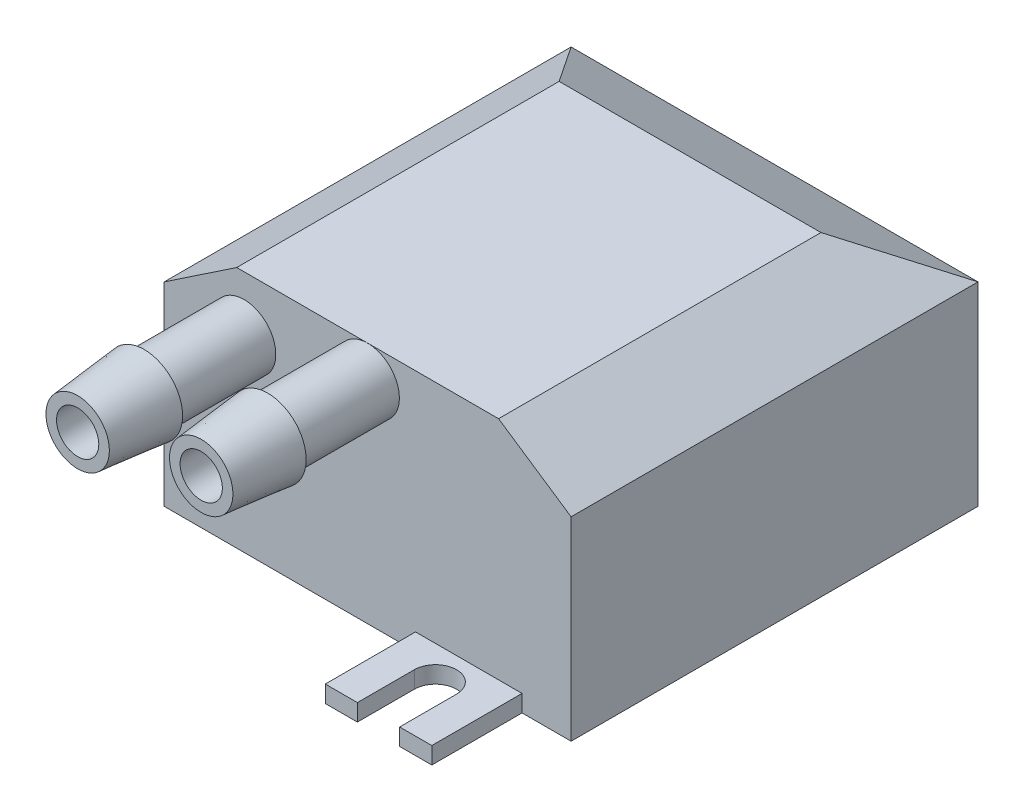
ISO-10303-21;
HEADER;
FILE_DESCRIPTION(('STEP AP214'),'2;1');
FILE_NAME('part.step','',(''),(''),'','','');
FILE_SCHEMA(('AUTOMOTIVE_DESIGN { 1 0 10303 214 1 1 1 1 }'));
ENDSEC;
DATA;
#1=APPLICATION_CONTEXT('core data for automotive mechanical design processes');
#2=APPLICATION_PROTOCOL_DEFINITION('international standard','automotive_design',2000,#1);
#3=PRODUCT_CONTEXT('',#1,'mechanical');
#4=PRODUCT('Part','Part','',(#3));
#5=PRODUCT_RELATED_PRODUCT_CATEGORY('part','',(#4));
#6=PRODUCT_DEFINITION_FORMATION('','',#4);
#7=PRODUCT_DEFINITION_CONTEXT('part definition',#1,'design');
#8=PRODUCT_DEFINITION('design','',#6,#7);
#9=PRODUCT_DEFINITION_SHAPE('','',#8);
#10=(LENGTH_UNIT() NAMED_UNIT(*) SI_UNIT(.MILLI.,.METRE.));
#11=(NAMED_UNIT(*) PLANE_ANGLE_UNIT() SI_UNIT($,.RADIAN.));
#12=(NAMED_UNIT(*) SI_UNIT($,.STERADIAN.) SOLID_ANGLE_UNIT());
#13=UNCERTAINTY_MEASURE_WITH_UNIT(LENGTH_MEASURE(1.E-05),#10,'distance_accuracy_value','');
#14=(GEOMETRIC_REPRESENTATION_CONTEXT(3) GLOBAL_UNCERTAINTY_ASSIGNED_CONTEXT((#13)) GLOBAL_UNIT_ASSIGNED_CONTEXT((#10,
#11,#12)) REPRESENTATION_CONTEXT('',''));
#15=CARTESIAN_POINT('',(0.,0.,0.));
#16=DIRECTION('',(0.,0.,1.));
#17=DIRECTION('',(1.,0.,0.));
#18=AXIS2_PLACEMENT_3D('',#15,#16,#17);
#19=CARTESIAN_POINT('',(-18.559375,28.1429839607597,55.559375));
#20=DIRECTION('',(0.,0.,-1.));
#21=DIRECTION('',(-1.,0.,0.));
#22=AXIS2_PLACEMENT_3D('',#19,#20,#21);
#23=CYLINDRICAL_SURFACE('',#22,4.7625);
#24=CARTESIAN_POINT('',(-18.559375,28.1429839607597,30.559375));
#25=DIRECTION('',(0.,0.,-1.));
#26=DIRECTION('',(-1.,0.,0.));
#27=AXIS2_PLACEMENT_3D('',#24,#25,#26);
#28=CIRCLE('',#27,4.7625);
#29=CARTESIAN_POINT('',(-23.321875,28.1429839607597,30.559375));
#30=VERTEX_POINT('',#29);
#31=EDGE_CURVE('E273',#30,#30,#28,.F.);
#32=ORIENTED_EDGE('',*,*,#31,.T.);
#33=EDGE_LOOP('',(#32));
#34=FACE_BOUND('',#33,.T.);
#35=CARTESIAN_POINT('',(-18.559375,28.1429839607597,45.559375));
#36=DIRECTION('',(0.,0.,1.));
#37=DIRECTION('',(1.,0.,0.));
#38=AXIS2_PLACEMENT_3D('',#35,#36,#37);
#39=CIRCLE('',#38,4.7625);
#40=CARTESIAN_POINT('',(-13.796875,28.1429839607597,45.559375));
#41=VERTEX_POINT('',#40);
#42=EDGE_CURVE('E12',#41,#41,#39,.T.);
#43=ORIENTED_EDGE('',*,*,#42,.F.);
#44=EDGE_LOOP('',(#43));
#45=FACE_BOUND('',#44,.T.);
#46=ADVANCED_FACE('F36',(#34,#45),#23,.T.);
#47=CARTESIAN_POINT('',(0.,31.7412831072353,55.559375));
#48=DIRECTION('',(0.,0.,-1.));
#49=DIRECTION('',(-1.,0.,0.));
#50=AXIS2_PLACEMENT_3D('',#47,#48,#49);
#51=CYLINDRICAL_SURFACE('',#50,4.7625);
#52=CARTESIAN_POINT('',(0.,31.7412831072353,30.559375));
#53=DIRECTION('',(0.,0.,-1.));
#54=DIRECTION('',(-1.,0.,0.));
#55=AXIS2_PLACEMENT_3D('',#52,#53,#54);
#56=CIRCLE('',#55,4.7625);
#57=CARTESIAN_POINT('',(-4.7625,31.7412831072353,30.559375));
#58=VERTEX_POINT('',#57);
#59=EDGE_CURVE('E270',#58,#58,#56,.F.);
#60=ORIENTED_EDGE('',*,*,#59,.T.);
#61=EDGE_LOOP('',(#60));
#62=FACE_BOUND('',#61,.T.);
#63=CARTESIAN_POINT('',(0.,31.7412831072353,45.559375));
#64=DIRECTION('',(0.,0.,1.));
#65=DIRECTION('',(1.,0.,0.));
#66=AXIS2_PLACEMENT_3D('',#63,#64,#65);
#67=CIRCLE('',#66,4.7625);
#68=CARTESIAN_POINT('',(4.7625,31.7412831072353,45.559375));
#69=VERTEX_POINT('',#68);
#70=EDGE_CURVE('E44',#69,#69,#67,.T.);
#71=ORIENTED_EDGE('',*,*,#70,.F.);
#72=EDGE_LOOP('',(#71));
#73=FACE_BOUND('',#72,.T.);
#74=ADVANCED_FACE('F281',(#62,#73),#51,.T.);
#75=CARTESIAN_POINT('',(-30.559375,36.5125,30.559375));
#76=DIRECTION('',(0.,0.,-1.));
#77=DIRECTION('',(-1.,0.,0.));
#78=AXIS2_PLACEMENT_3D('',#75,#76,#77);
#79=PLANE('',#78);
#80=DIRECTION('',(1.,0.,0.));
#81=VECTOR('',#80,1.);
#82=CARTESIAN_POINT('',(-30.559375,0.,30.559375));
#83=LINE('',#82,#81);
#84=CARTESIAN_POINT('',(-30.559375,0.,30.559375));
#85=VERTEX_POINT('',#84);
#86=CARTESIAN_POINT('',(7.191375,0.,30.559375));
#87=VERTEX_POINT('',#86);
#88=EDGE_CURVE('E147',#85,#87,#83,.T.);
#89=ORIENTED_EDGE('',*,*,#88,.T.);
#90=DIRECTION('',(0.,-1.,0.));
#91=VECTOR('',#90,1.);
#92=CARTESIAN_POINT('',(7.191375,2.54,30.559375));
#93=LINE('',#92,#91);
#94=CARTESIAN_POINT('',(7.191375,2.54,30.559375));
#95=VERTEX_POINT('',#94);
#96=EDGE_CURVE('E51',#95,#87,#93,.T.);
#97=ORIENTED_EDGE('',*,*,#96,.F.);
#98=DIRECTION('',(1.,0.,0.));
#99=VECTOR('',#98,1.);
#100=CARTESIAN_POINT('',(7.191375,2.54,30.559375));
#101=LINE('',#100,#99);
#102=CARTESIAN_POINT('',(23.193375,2.54,30.559375));
#103=VERTEX_POINT('',#102);
#104=EDGE_CURVE('E55',#95,#103,#101,.T.);
#105=ORIENTED_EDGE('',*,*,#104,.T.);
#106=DIRECTION('',(0.,-1.,0.));
#107=VECTOR('',#106,1.);
#108=CARTESIAN_POINT('',(23.193375,2.54,30.559375));
#109=LINE('',#108,#107);
#110=CARTESIAN_POINT('',(23.193375,0.,30.559375));
#111=VERTEX_POINT('',#110);
#112=EDGE_CURVE('E150',#103,#111,#109,.T.);
#113=ORIENTED_EDGE('',*,*,#112,.T.);
#114=CARTESIAN_POINT('',(30.559375,0.,30.559375));
#115=VERTEX_POINT('',#114);
#116=EDGE_CURVE('E136',#111,#115,#83,.T.);
#117=ORIENTED_EDGE('',*,*,#116,.T.);
#118=DIRECTION('',(0.,-1.,0.));
#119=VECTOR('',#118,1.);
#120=CARTESIAN_POINT('',(30.559375,36.5125,30.559375));
#121=LINE('',#120,#119);
#122=CARTESIAN_POINT('',(30.559375,29.1971300080494,30.559375));
#123=VERTEX_POINT('',#122);
#124=EDGE_CURVE('E258',#123,#115,#121,.T.);
#125=ORIENTED_EDGE('',*,*,#124,.F.);
#126=DIRECTION('',(-0.830205403740083,0.557457610586461,0.));
#127=VECTOR('',#126,1.);
#128=CARTESIAN_POINT('',(19.6648072654486,36.5125,30.559375));
#129=LINE('',#128,#127);
#130=CARTESIAN_POINT('',(19.6648072654486,36.5125,30.559375));
#131=VERTEX_POINT('',#130);
#132=EDGE_CURVE('E237',#123,#131,#129,.T.);
#133=ORIENTED_EDGE('',*,*,#132,.T.);
#134=DIRECTION('',(1.,0.,0.));
#135=VECTOR('',#134,1.);
#136=CARTESIAN_POINT('',(-30.559375,36.5125,30.559375));
#137=LINE('',#136,#135);
#138=CARTESIAN_POINT('',(-19.6648072654486,36.5125,30.559375));
#139=VERTEX_POINT('',#138);
#140=EDGE_CURVE('E251',#139,#131,#137,.T.);
#141=ORIENTED_EDGE('',*,*,#140,.F.);
#142=DIRECTION('',(-0.830205403740083,-0.557457610586461,0.));
#143=VECTOR('',#142,1.);
#144=CARTESIAN_POINT('',(-19.6648072654486,36.5125,30.559375));
#145=LINE('',#144,#143);
#146=CARTESIAN_POINT('',(-30.559375,29.1971300080494,30.559375));
#147=VERTEX_POINT('',#146);
#148=EDGE_CURVE('E234',#139,#147,#145,.T.);
#149=ORIENTED_EDGE('',*,*,#148,.T.);
#150=DIRECTION('',(0.,-1.,0.));
#151=VECTOR('',#150,1.);
#152=CARTESIAN_POINT('',(-30.559375,36.5125,30.559375));
#153=LINE('',#152,#151);
#154=EDGE_CURVE('E260',#147,#85,#153,.T.);
#155=ORIENTED_EDGE('',*,*,#154,.T.);
#156=EDGE_LOOP('',(#89,#97,#105,#113,#117,#125,#133,#141,#149,#155));
#157=FACE_BOUND('',#156,.T.);
#158=ORIENTED_EDGE('',*,*,#59,.F.);
#159=EDGE_LOOP('',(#158));
#160=FACE_BOUND('',#159,.T.);
#161=ORIENTED_EDGE('',*,*,#31,.F.);
#162=EDGE_LOOP('',(#161));
#163=FACE_BOUND('',#162,.T.);
#164=ADVANCED_FACE('F151',(#157,#160,#163),#79,.F.);
#165=CARTESIAN_POINT('',(-30.559375,36.5125,-30.559375));
#166=DIRECTION('',(0.,0.,1.));
#167=DIRECTION('',(1.,0.,0.));
#168=AXIS2_PLACEMENT_3D('',#165,#166,#167);
#169=PLANE('',#168);
#170=DIRECTION('',(1.,0.,0.));
#171=VECTOR('',#170,1.);
#172=CARTESIAN_POINT('',(-219.440625,29.1971300080494,-30.559375));
#173=LINE('',#172,#171);
#174=CARTESIAN_POINT('',(-30.559375,29.1971300080494,-30.559375));
#175=VERTEX_POINT('',#174);
#176=CARTESIAN_POINT('',(30.559375,29.1971300080494,-30.559375));
#177=VERTEX_POINT('',#176);
#178=EDGE_CURVE('E226',#175,#177,#173,.T.);
#179=ORIENTED_EDGE('',*,*,#178,.T.);
#180=DIRECTION('',(0.,-1.,0.));
#181=VECTOR('',#180,1.);
#182=CARTESIAN_POINT('',(30.559375,36.5125,-30.559375));
#183=LINE('',#182,#181);
#184=CARTESIAN_POINT('',(30.559375,0.,-30.559375));
#185=VERTEX_POINT('',#184);
#186=EDGE_CURVE('E256',#177,#185,#183,.T.);
#187=ORIENTED_EDGE('',*,*,#186,.T.);
#188=DIRECTION('',(-1.,0.,0.));
#189=VECTOR('',#188,1.);
#190=CARTESIAN_POINT('',(-30.559375,0.,-30.559375));
#191=LINE('',#190,#189);
#192=CARTESIAN_POINT('',(-30.559375,0.,-30.559375));
#193=VERTEX_POINT('',#192);
#194=EDGE_CURVE('E248',#185,#193,#191,.T.);
#195=ORIENTED_EDGE('',*,*,#194,.T.);
#196=DIRECTION('',(0.,-1.,0.));
#197=VECTOR('',#196,1.);
#198=CARTESIAN_POINT('',(-30.559375,36.5125,-30.559375));
#199=LINE('',#198,#197);
#200=EDGE_CURVE('E254',#175,#193,#199,.T.);
#201=ORIENTED_EDGE('',*,*,#200,.F.);
#202=EDGE_LOOP('',(#179,#187,#195,#201));
#203=FACE_BOUND('',#202,.T.);
#204=ADVANCED_FACE('F289',(#203),#169,.F.);
#205=CARTESIAN_POINT('',(-30.559375,36.5125,30.559375));
#206=DIRECTION('',(0.,1.,0.));
#207=DIRECTION('',(0.,0.,1.));
#208=AXIS2_PLACEMENT_3D('',#205,#206,#207);
#209=PLANE('',#208);
#210=DIRECTION('',(0.,0.,-1.));
#211=VECTOR('',#210,1.);
#212=CARTESIAN_POINT('',(19.6648072654486,36.5125,30.559375));
#213=LINE('',#212,#211);
#214=CARTESIAN_POINT('',(19.6648072654486,36.5125,-17.867202311095));
#215=VERTEX_POINT('',#214);
#216=EDGE_CURVE('E264',#131,#215,#213,.T.);
#217=ORIENTED_EDGE('',*,*,#216,.T.);
#218=DIRECTION('',(1.,0.,0.));
#219=VECTOR('',#218,1.);
#220=CARTESIAN_POINT('',(-219.440625,36.5125,-17.867202311095));
#221=LINE('',#220,#219);
#222=CARTESIAN_POINT('',(-19.6648072654485,36.5125,-17.867202311095));
#223=VERTEX_POINT('',#222);
#224=EDGE_CURVE('E227',#223,#215,#221,.T.);
#225=ORIENTED_EDGE('',*,*,#224,.F.);
#226=DIRECTION('',(0.,0.,1.));
#227=VECTOR('',#226,1.);
#228=CARTESIAN_POINT('',(-19.6648072654486,36.5125,30.559375));
#229=LINE('',#228,#227);
#230=EDGE_CURVE('E262',#223,#139,#229,.T.);
#231=ORIENTED_EDGE('',*,*,#230,.T.);
#232=ORIENTED_EDGE('',*,*,#140,.T.);
#233=EDGE_LOOP('',(#217,#225,#231,#232));
#234=FACE_BOUND('',#233,.T.);
#235=ADVANCED_FACE('F310',(#234),#209,.T.);
#236=CARTESIAN_POINT('',(-19.6648072654486,36.5125,-31.440625));
#237=DIRECTION('',(-0.557457610586461,0.830205403740083,0.));
#238=DIRECTION('',(-0.830205403740083,-0.557457610586461,0.));
#239=AXIS2_PLACEMENT_3D('',#236,#237,#238);
#240=PLANE('',#239);
#241=ORIENTED_EDGE('',*,*,#230,.F.);
#242=DIRECTION('',(-0.596752133871766,-0.400700859283585,-0.695216305971667));
#243=VECTOR('',#242,1.);
#244=CARTESIAN_POINT('',(-25.296037759819,32.7313004535849,-24.4275864976935));
#245=LINE('',#244,#243);
#246=EDGE_CURVE('E229',#223,#175,#245,.T.);
#247=ORIENTED_EDGE('',*,*,#246,.T.);
#248=DIRECTION('',(0.,0.,1.));
#249=VECTOR('',#248,1.);
#250=CARTESIAN_POINT('',(-30.559375,29.1971300080494,-31.440625));
#251=LINE('',#250,#249);
#252=EDGE_CURVE('E240',#175,#147,#251,.T.);
#253=ORIENTED_EDGE('',*,*,#252,.T.);
#254=ORIENTED_EDGE('',*,*,#148,.F.);
#255=EDGE_LOOP('',(#241,#247,#253,#254));
#256=FACE_BOUND('',#255,.T.);
#257=ADVANCED_FACE('F306',(#256),#240,.T.);
#258=CARTESIAN_POINT('',(19.6648072654486,36.5125,-31.440625));
#259=DIRECTION('',(0.557457610586461,0.830205403740083,0.));
#260=DIRECTION('',(-0.830205403740083,0.557457610586461,0.));
#261=AXIS2_PLACEMENT_3D('',#258,#259,#260);
#262=PLANE('',#261);
#263=DIRECTION('',(0.,0.,1.));
#264=VECTOR('',#263,1.);
#265=CARTESIAN_POINT('',(30.559375,29.1971300080494,-31.440625));
#266=LINE('',#265,#264);
#267=EDGE_CURVE('E241',#177,#123,#266,.T.);
#268=ORIENTED_EDGE('',*,*,#267,.F.);
#269=DIRECTION('',(-0.596752133871766,0.400700859283585,0.695216305971667));
#270=VECTOR('',#269,1.);
#271=CARTESIAN_POINT('',(25.296037759819,32.7313004535849,-24.4275864976935));
#272=LINE('',#271,#270);
#273=EDGE_CURVE('E267',#177,#215,#272,.T.);
#274=ORIENTED_EDGE('',*,*,#273,.T.);
#275=ORIENTED_EDGE('',*,*,#216,.F.);
#276=ORIENTED_EDGE('',*,*,#132,.F.);
#277=EDGE_LOOP('',(#268,#274,#275,#276));
#278=FACE_BOUND('',#277,.T.);
#279=ADVANCED_FACE('F303',(#278),#262,.T.);
#280=CARTESIAN_POINT('',(-30.559375,36.5125,-30.559375));
#281=DIRECTION('',(1.,0.,0.));
#282=DIRECTION('',(0.,0.,-1.));
#283=AXIS2_PLACEMENT_3D('',#280,#281,#282);
#284=PLANE('',#283);
#285=ORIENTED_EDGE('',*,*,#252,.F.);
#286=ORIENTED_EDGE('',*,*,#200,.T.);
#287=DIRECTION('',(0.,0.,1.));
#288=VECTOR('',#287,1.);
#289=CARTESIAN_POINT('',(-30.559375,0.,-30.559375));
#290=LINE('',#289,#288);
#291=EDGE_CURVE('E148',#193,#85,#290,.T.);
#292=ORIENTED_EDGE('',*,*,#291,.T.);
#293=ORIENTED_EDGE('',*,*,#154,.F.);
#294=EDGE_LOOP('',(#285,#286,#292,#293));
#295=FACE_BOUND('',#294,.T.);
#296=ADVANCED_FACE('F38',(#295),#284,.F.);
#297=CARTESIAN_POINT('',(30.559375,36.5125,-30.559375));
#298=DIRECTION('',(-1.,0.,0.));
#299=DIRECTION('',(0.,0.,1.));
#300=AXIS2_PLACEMENT_3D('',#297,#298,#299);
#301=PLANE('',#300);
#302=ORIENTED_EDGE('',*,*,#267,.T.);
#303=ORIENTED_EDGE('',*,*,#124,.T.);
#304=DIRECTION('',(0.,0.,-1.));
#305=VECTOR('',#304,1.);
#306=CARTESIAN_POINT('',(30.559375,0.,-30.559375));
#307=LINE('',#306,#305);
#308=EDGE_CURVE('E144',#115,#185,#307,.T.);
#309=ORIENTED_EDGE('',*,*,#308,.T.);
#310=ORIENTED_EDGE('',*,*,#186,.F.);
#311=EDGE_LOOP('',(#302,#303,#309,#310));
#312=FACE_BOUND('',#311,.T.);
#313=ADVANCED_FACE('F314',(#312),#301,.F.);
#314=CARTESIAN_POINT('',(-30.559375,0.,30.559375));
#315=DIRECTION('',(0.,1.,0.));
#316=DIRECTION('',(0.,0.,1.));
#317=AXIS2_PLACEMENT_3D('',#314,#315,#316);
#318=PLANE('',#317);
#319=ORIENTED_EDGE('',*,*,#291,.F.);
#320=ORIENTED_EDGE('',*,*,#194,.F.);
#321=ORIENTED_EDGE('',*,*,#308,.F.);
#322=ORIENTED_EDGE('',*,*,#116,.F.);
#323=DIRECTION('',(0.,0.,1.));
#324=VECTOR('',#323,1.);
#325=CARTESIAN_POINT('',(23.193375,0.,30.559375));
#326=LINE('',#325,#324);
#327=CARTESIAN_POINT('',(23.193375,0.,44.116625));
#328=VERTEX_POINT('',#327);
#329=EDGE_CURVE('E141',#111,#328,#326,.T.);
#330=ORIENTED_EDGE('',*,*,#329,.T.);
#331=DIRECTION('',(-1.,0.,0.));
#332=VECTOR('',#331,1.);
#333=CARTESIAN_POINT('',(23.193375,0.,44.116625));
#334=LINE('',#333,#332);
#335=CARTESIAN_POINT('',(18.367375,0.,44.116625));
#336=VERTEX_POINT('',#335);
#337=EDGE_CURVE('E160',#328,#336,#334,.T.);
#338=ORIENTED_EDGE('',*,*,#337,.T.);
#339=DIRECTION('',(0.,0.,-1.));
#340=VECTOR('',#339,1.);
#341=CARTESIAN_POINT('',(18.367375,0.,44.116625));
#342=LINE('',#341,#340);
#343=CARTESIAN_POINT('',(18.367375,0.,35.5645232558141));
#344=VERTEX_POINT('',#343);
#345=EDGE_CURVE('E163',#336,#344,#342,.T.);
#346=ORIENTED_EDGE('',*,*,#345,.T.);
#347=CARTESIAN_POINT('',(15.192375,0.,35.5645232558141));
#348=DIRECTION('',(0.,1.,0.));
#349=DIRECTION('',(0.,0.,-1.));
#350=AXIS2_PLACEMENT_3D('',#347,#348,#349);
#351=CIRCLE('',#350,3.175);
#352=CARTESIAN_POINT('',(12.017375,0.,35.5645232558141));
#353=VERTEX_POINT('',#352);
#354=EDGE_CURVE('E172',#344,#353,#351,.T.);
#355=ORIENTED_EDGE('',*,*,#354,.T.);
#356=DIRECTION('',(0.,0.,1.));
#357=VECTOR('',#356,1.);
#358=CARTESIAN_POINT('',(12.017375,0.,44.116625));
#359=LINE('',#358,#357);
#360=CARTESIAN_POINT('',(12.017375,0.,44.116625));
#361=VERTEX_POINT('',#360);
#362=EDGE_CURVE('E175',#353,#361,#359,.T.);
#363=ORIENTED_EDGE('',*,*,#362,.T.);
#364=DIRECTION('',(-1.,0.,0.));
#365=VECTOR('',#364,1.);
#366=CARTESIAN_POINT('',(7.191375,0.,44.116625));
#367=LINE('',#366,#365);
#368=CARTESIAN_POINT('',(7.191375,0.,44.116625));
#369=VERTEX_POINT('',#368);
#370=EDGE_CURVE('E178',#361,#369,#367,.T.);
#371=ORIENTED_EDGE('',*,*,#370,.T.);
#372=DIRECTION('',(0.,0.,-1.));
#373=VECTOR('',#372,1.);
#374=CARTESIAN_POINT('',(7.191375,0.,30.559375));
#375=LINE('',#374,#373);
#376=EDGE_CURVE('E161',#369,#87,#375,.T.);
#377=ORIENTED_EDGE('',*,*,#376,.T.);
#378=ORIENTED_EDGE('',*,*,#88,.F.);
#379=EDGE_LOOP('',(#319,#320,#321,#322,#330,#338,#346,#355,#363,#371,#377,#378));
#380=FACE_BOUND('',#379,.T.);
#381=ADVANCED_FACE('F138',(#380),#318,.F.);
#382=CARTESIAN_POINT('',(-219.440625,36.5125,-17.867202311095));
#383=DIRECTION('',(0.,0.866393445696256,-0.499361990198061));
#384=DIRECTION('',(0.,0.499361990198061,0.866393445696256));
#385=AXIS2_PLACEMENT_3D('',#382,#383,#384);
#386=PLANE('',#385);
#387=ORIENTED_EDGE('',*,*,#224,.T.);
#388=ORIENTED_EDGE('',*,*,#273,.F.);
#389=ORIENTED_EDGE('',*,*,#178,.F.);
#390=ORIENTED_EDGE('',*,*,#246,.F.);
#391=EDGE_LOOP('',(#387,#388,#389,#390));
#392=FACE_BOUND('',#391,.T.);
#393=ADVANCED_FACE('F298',(#392),#386,.T.);
#394=CARTESIAN_POINT('',(7.191375,2.54,30.559375));
#395=DIRECTION('',(-1.,0.,0.));
#396=DIRECTION('',(0.,0.,1.));
#397=AXIS2_PLACEMENT_3D('',#394,#395,#396);
#398=PLANE('',#397);
#399=ORIENTED_EDGE('',*,*,#376,.F.);
#400=DIRECTION('',(0.,-1.,0.));
#401=VECTOR('',#400,1.);
#402=CARTESIAN_POINT('',(7.191375,2.54,44.116625));
#403=LINE('',#402,#401);
#404=CARTESIAN_POINT('',(7.191375,2.54,44.116625));
#405=VERTEX_POINT('',#404);
#406=EDGE_CURVE('E202',#405,#369,#403,.T.);
#407=ORIENTED_EDGE('',*,*,#406,.F.);
#408=DIRECTION('',(0.,0.,-1.));
#409=VECTOR('',#408,1.);
#410=CARTESIAN_POINT('',(7.191375,2.54,30.559375));
#411=LINE('',#410,#409);
#412=EDGE_CURVE('E181',#405,#95,#411,.T.);
#413=ORIENTED_EDGE('',*,*,#412,.T.);
#414=ORIENTED_EDGE('',*,*,#96,.T.);
#415=EDGE_LOOP('',(#399,#407,#413,#414));
#416=FACE_BOUND('',#415,.T.);
#417=ADVANCED_FACE('F301',(#416),#398,.T.);
#418=CARTESIAN_POINT('',(7.191375,2.54,44.116625));
#419=DIRECTION('',(0.,0.,1.));
#420=DIRECTION('',(1.,0.,0.));
#421=AXIS2_PLACEMENT_3D('',#418,#419,#420);
#422=PLANE('',#421);
#423=ORIENTED_EDGE('',*,*,#370,.F.);
#424=DIRECTION('',(0.,-1.,0.));
#425=VECTOR('',#424,1.);
#426=CARTESIAN_POINT('',(12.017375,2.54,44.116625));
#427=LINE('',#426,#425);
#428=CARTESIAN_POINT('',(12.017375,2.54,44.116625));
#429=VERTEX_POINT('',#428);
#430=EDGE_CURVE('E205',#429,#361,#427,.T.);
#431=ORIENTED_EDGE('',*,*,#430,.F.);
#432=DIRECTION('',(-1.,0.,0.));
#433=VECTOR('',#432,1.);
#434=CARTESIAN_POINT('',(7.191375,2.54,44.116625));
#435=LINE('',#434,#433);
#436=EDGE_CURVE('E199',#429,#405,#435,.T.);
#437=ORIENTED_EDGE('',*,*,#436,.T.);
#438=ORIENTED_EDGE('',*,*,#406,.T.);
#439=EDGE_LOOP('',(#423,#431,#437,#438));
#440=FACE_BOUND('',#439,.T.);
#441=ADVANCED_FACE('F364',(#440),#422,.T.);
#442=CARTESIAN_POINT('',(12.017375,2.54,44.116625));
#443=DIRECTION('',(1.,0.,0.));
#444=DIRECTION('',(0.,0.,-1.));
#445=AXIS2_PLACEMENT_3D('',#442,#443,#444);
#446=PLANE('',#445);
#447=ORIENTED_EDGE('',*,*,#362,.F.);
#448=DIRECTION('',(0.,-1.,0.));
#449=VECTOR('',#448,1.);
#450=CARTESIAN_POINT('',(12.017375,2.54,35.5645232558141));
#451=LINE('',#450,#449);
#452=CARTESIAN_POINT('',(12.017375,2.54,35.5645232558141));
#453=VERTEX_POINT('',#452);
#454=EDGE_CURVE('E207',#453,#353,#451,.T.);
#455=ORIENTED_EDGE('',*,*,#454,.F.);
#456=DIRECTION('',(0.,0.,1.));
#457=VECTOR('',#456,1.);
#458=CARTESIAN_POINT('',(12.017375,2.54,44.116625));
#459=LINE('',#458,#457);
#460=EDGE_CURVE('E196',#453,#429,#459,.T.);
#461=ORIENTED_EDGE('',*,*,#460,.T.);
#462=ORIENTED_EDGE('',*,*,#430,.T.);
#463=EDGE_LOOP('',(#447,#455,#461,#462));
#464=FACE_BOUND('',#463,.T.);
#465=ADVANCED_FACE('F367',(#464),#446,.T.);
#466=CARTESIAN_POINT('',(15.192375,2.54,35.5645232558141));
#467=DIRECTION('',(0.,-1.,0.));
#468=DIRECTION('',(0.,0.,-1.));
#469=AXIS2_PLACEMENT_3D('',#466,#467,#468);
#470=CYLINDRICAL_SURFACE('',#469,3.175);
#471=ORIENTED_EDGE('',*,*,#354,.F.);
#472=DIRECTION('',(0.,-1.,0.));
#473=VECTOR('',#472,1.);
#474=CARTESIAN_POINT('',(18.367375,2.54,35.5645232558141));
#475=LINE('',#474,#473);
#476=CARTESIAN_POINT('',(18.367375,2.54,35.5645232558141));
#477=VERTEX_POINT('',#476);
#478=EDGE_CURVE('E209',#477,#344,#475,.T.);
#479=ORIENTED_EDGE('',*,*,#478,.F.);
#480=CARTESIAN_POINT('',(15.192375,2.54,35.5645232558141));
#481=DIRECTION('',(0.,1.,0.));
#482=DIRECTION('',(0.,0.,-1.));
#483=AXIS2_PLACEMENT_3D('',#480,#481,#482);
#484=CIRCLE('',#483,3.175);
#485=EDGE_CURVE('E193',#477,#453,#484,.T.);
#486=ORIENTED_EDGE('',*,*,#485,.T.);
#487=ORIENTED_EDGE('',*,*,#454,.T.);
#488=EDGE_LOOP('',(#471,#479,#486,#487));
#489=FACE_BOUND('',#488,.T.);
#490=ADVANCED_FACE('F371',(#489),#470,.F.);
#491=CARTESIAN_POINT('',(18.367375,2.54,44.116625));
#492=DIRECTION('',(-1.,0.,0.));
#493=DIRECTION('',(0.,0.,1.));
#494=AXIS2_PLACEMENT_3D('',#491,#492,#493);
#495=PLANE('',#494);
#496=ORIENTED_EDGE('',*,*,#345,.F.);
#497=DIRECTION('',(0.,-1.,0.));
#498=VECTOR('',#497,1.);
#499=CARTESIAN_POINT('',(18.367375,2.54,44.116625));
#500=LINE('',#499,#498);
#501=CARTESIAN_POINT('',(18.367375,2.54,44.116625));
#502=VERTEX_POINT('',#501);
#503=EDGE_CURVE('E211',#502,#336,#500,.T.);
#504=ORIENTED_EDGE('',*,*,#503,.F.);
#505=DIRECTION('',(0.,0.,-1.));
#506=VECTOR('',#505,1.);
#507=CARTESIAN_POINT('',(18.367375,2.54,44.116625));
#508=LINE('',#507,#506);
#509=EDGE_CURVE('E190',#502,#477,#508,.T.);
#510=ORIENTED_EDGE('',*,*,#509,.T.);
#511=ORIENTED_EDGE('',*,*,#478,.T.);
#512=EDGE_LOOP('',(#496,#504,#510,#511));
#513=FACE_BOUND('',#512,.T.);
#514=ADVANCED_FACE('F375',(#513),#495,.T.);
#515=CARTESIAN_POINT('',(23.193375,2.54,44.116625));
#516=DIRECTION('',(0.,0.,1.));
#517=DIRECTION('',(1.,0.,0.));
#518=AXIS2_PLACEMENT_3D('',#515,#516,#517);
#519=PLANE('',#518);
#520=ORIENTED_EDGE('',*,*,#337,.F.);
#521=DIRECTION('',(0.,-1.,0.));
#522=VECTOR('',#521,1.);
#523=CARTESIAN_POINT('',(23.193375,2.54,44.116625));
#524=LINE('',#523,#522);
#525=CARTESIAN_POINT('',(23.193375,2.54,44.116625));
#526=VERTEX_POINT('',#525);
#527=EDGE_CURVE('E156',#526,#328,#524,.T.);
#528=ORIENTED_EDGE('',*,*,#527,.F.);
#529=DIRECTION('',(-1.,0.,0.));
#530=VECTOR('',#529,1.);
#531=CARTESIAN_POINT('',(23.193375,2.54,44.116625));
#532=LINE('',#531,#530);
#533=EDGE_CURVE('E187',#526,#502,#532,.T.);
#534=ORIENTED_EDGE('',*,*,#533,.T.);
#535=ORIENTED_EDGE('',*,*,#503,.T.);
#536=EDGE_LOOP('',(#520,#528,#534,#535));
#537=FACE_BOUND('',#536,.T.);
#538=ADVANCED_FACE('F379',(#537),#519,.T.);
#539=CARTESIAN_POINT('',(23.193375,2.54,30.559375));
#540=DIRECTION('',(1.,0.,0.));
#541=DIRECTION('',(0.,0.,-1.));
#542=AXIS2_PLACEMENT_3D('',#539,#540,#541);
#543=PLANE('',#542);
#544=ORIENTED_EDGE('',*,*,#329,.F.);
#545=ORIENTED_EDGE('',*,*,#112,.F.);
#546=DIRECTION('',(0.,0.,1.));
#547=VECTOR('',#546,1.);
#548=CARTESIAN_POINT('',(23.193375,2.54,30.559375));
#549=LINE('',#548,#547);
#550=EDGE_CURVE('E185',#103,#526,#549,.T.);
#551=ORIENTED_EDGE('',*,*,#550,.T.);
#552=ORIENTED_EDGE('',*,*,#527,.T.);
#553=EDGE_LOOP('',(#544,#545,#551,#552));
#554=FACE_BOUND('',#553,.T.);
#555=ADVANCED_FACE('F158',(#554),#543,.T.);
#556=CARTESIAN_POINT('',(15.192375,2.54,35.5645232558141));
#557=DIRECTION('',(0.,-1.,0.));
#558=DIRECTION('',(0.,0.,-1.));
#559=AXIS2_PLACEMENT_3D('',#556,#557,#558);
#560=PLANE('',#559);
#561=ORIENTED_EDGE('',*,*,#412,.F.);
#562=ORIENTED_EDGE('',*,*,#436,.F.);
#563=ORIENTED_EDGE('',*,*,#460,.F.);
#564=ORIENTED_EDGE('',*,*,#485,.F.);
#565=ORIENTED_EDGE('',*,*,#509,.F.);
#566=ORIENTED_EDGE('',*,*,#533,.F.);
#567=ORIENTED_EDGE('',*,*,#550,.F.);
#568=ORIENTED_EDGE('',*,*,#104,.F.);
#569=EDGE_LOOP('',(#561,#562,#563,#564,#565,#566,#567,#568));
#570=FACE_BOUND('',#569,.T.);
#571=ADVANCED_FACE('F360',(#570),#560,.F.);
#572=CARTESIAN_POINT('',(0.,31.7412831072353,45.559375));
#573=DIRECTION('',(0.,0.,1.));
#574=DIRECTION('',(1.,0.,0.));
#575=AXIS2_PLACEMENT_3D('',#572,#573,#574);
#576=PLANE('',#575);
#577=ORIENTED_EDGE('',*,*,#70,.T.);
#578=EDGE_LOOP('',(#577));
#579=FACE_BOUND('',#578,.T.);
#580=CARTESIAN_POINT('',(0.,31.7412831072353,45.559375));
#581=DIRECTION('',(0.,0.,1.));
#582=DIRECTION('',(1.,0.,0.));
#583=AXIS2_PLACEMENT_3D('',#580,#581,#582);
#584=CIRCLE('',#583,5.76);
#585=CARTESIAN_POINT('',(5.76,31.7412831072353,45.559375));
#586=VERTEX_POINT('',#585);
#587=EDGE_CURVE('E166',#586,#586,#584,.T.);
#588=ORIENTED_EDGE('',*,*,#587,.F.);
#589=EDGE_LOOP('',(#588));
#590=FACE_BOUND('',#589,.T.);
#591=ADVANCED_FACE('F278',(#579,#590),#576,.F.);
#592=CARTESIAN_POINT('',(0.,31.7412831072353,55.559375));
#593=DIRECTION('',(0.,0.,-1.));
#594=DIRECTION('',(-1.,0.,0.));
#595=AXIS2_PLACEMENT_3D('',#592,#593,#594);
#596=CONICAL_SURFACE('',#595,4.7625,0.0994211216167402);
#597=ORIENTED_EDGE('',*,*,#587,.T.);
#598=EDGE_LOOP('',(#597));
#599=FACE_BOUND('',#598,.T.);
#600=CARTESIAN_POINT('',(0.,31.7412831072353,55.559375));
#601=DIRECTION('',(0.,0.,1.));
#602=DIRECTION('',(1.,0.,0.));
#603=AXIS2_PLACEMENT_3D('',#600,#601,#602);
#604=CIRCLE('',#603,4.7625);
#605=CARTESIAN_POINT('',(4.7625,31.7412831072353,55.559375));
#606=VERTEX_POINT('',#605);
#607=EDGE_CURVE('E401',#606,#606,#604,.T.);
#608=ORIENTED_EDGE('',*,*,#607,.F.);
#609=EDGE_LOOP('',(#608));
#610=FACE_BOUND('',#609,.T.);
#611=ADVANCED_FACE('F325',(#599,#610),#596,.T.);
#612=CARTESIAN_POINT('',(0.,31.7412831072353,30.559375));
#613=DIRECTION('',(0.,0.,1.));
#614=DIRECTION('',(1.,0.,0.));
#615=AXIS2_PLACEMENT_3D('',#612,#613,#614);
#616=CIRCLE('',#615,3.175);
#617=CARTESIAN_POINT('',(3.175,31.7412831072353,30.559375));
#618=VERTEX_POINT('',#617);
#619=EDGE_CURVE('E220',#618,#618,#616,.T.);
#620=ORIENTED_EDGE('',*,*,#619,.T.);
#621=EDGE_LOOP('',(#620));
#622=FACE_BOUND('',#621,.T.);
#623=ADVANCED_FACE('F291',(#622),#79,.F.);
#624=CARTESIAN_POINT('',(0.,31.7412831072353,55.559375));
#625=DIRECTION('',(0.,0.,-1.));
#626=DIRECTION('',(-1.,0.,0.));
#627=AXIS2_PLACEMENT_3D('',#624,#625,#626);
#628=CYLINDRICAL_SURFACE('',#627,3.175);
#629=CARTESIAN_POINT('',(0.,31.7412831072353,55.559375));
#630=DIRECTION('',(0.,0.,1.));
#631=DIRECTION('',(1.,0.,0.));
#632=AXIS2_PLACEMENT_3D('',#629,#630,#631);
#633=CIRCLE('',#632,3.175);
#634=CARTESIAN_POINT('',(3.175,31.7412831072353,55.559375));
#635=VERTEX_POINT('',#634);
#636=EDGE_CURVE('E223',#635,#635,#633,.T.);
#637=ORIENTED_EDGE('',*,*,#636,.T.);
#638=EDGE_LOOP('',(#637));
#639=FACE_BOUND('',#638,.T.);
#640=ORIENTED_EDGE('',*,*,#619,.F.);
#641=EDGE_LOOP('',(#640));
#642=FACE_BOUND('',#641,.T.);
#643=ADVANCED_FACE('F324',(#639,#642),#628,.F.);
#644=CARTESIAN_POINT('',(0.,31.7412831072353,55.559375));
#645=DIRECTION('',(0.,0.,1.));
#646=DIRECTION('',(1.,0.,0.));
#647=AXIS2_PLACEMENT_3D('',#644,#645,#646);
#648=PLANE('',#647);
#649=ORIENTED_EDGE('',*,*,#636,.F.);
#650=EDGE_LOOP('',(#649));
#651=FACE_BOUND('',#650,.T.);
#652=ORIENTED_EDGE('',*,*,#607,.T.);
#653=EDGE_LOOP('',(#652));
#654=FACE_BOUND('',#653,.T.);
#655=ADVANCED_FACE('F296',(#651,#654),#648,.T.);
#656=CARTESIAN_POINT('',(-18.559375,28.1429839607597,45.559375));
#657=DIRECTION('',(0.,0.,-1.));
#658=DIRECTION('',(-1.,0.,0.));
#659=AXIS2_PLACEMENT_3D('',#656,#657,#658);
#660=CONICAL_SURFACE('',#659,5.7625,0.0996686524911621);
#661=CARTESIAN_POINT('',(-18.559375,28.1429839607597,55.559375));
#662=DIRECTION('',(0.,0.,1.));
#663=DIRECTION('',(1.,0.,0.));
#664=AXIS2_PLACEMENT_3D('',#661,#662,#663);
#665=CIRCLE('',#664,4.7625);
#666=CARTESIAN_POINT('',(-13.796875,28.1429839607597,55.559375));
#667=VERTEX_POINT('',#666);
#668=EDGE_CURVE('E396',#667,#667,#665,.T.);
#669=ORIENTED_EDGE('',*,*,#668,.F.);
#670=EDGE_LOOP('',(#669));
#671=FACE_BOUND('',#670,.T.);
#672=CARTESIAN_POINT('',(-18.559375,28.1429839607597,45.559375));
#673=DIRECTION('',(0.,0.,1.));
#674=DIRECTION('',(1.,0.,0.));
#675=AXIS2_PLACEMENT_3D('',#672,#673,#674);
#676=CIRCLE('',#675,5.7625);
#677=CARTESIAN_POINT('',(-12.796875,28.1429839607597,45.559375));
#678=VERTEX_POINT('',#677);
#679=EDGE_CURVE('E398',#678,#678,#676,.T.);
#680=ORIENTED_EDGE('',*,*,#679,.T.);
#681=EDGE_LOOP('',(#680));
#682=FACE_BOUND('',#681,.T.);
#683=ADVANCED_FACE('F345',(#671,#682),#660,.T.);
#684=CARTESIAN_POINT('',(-18.559375,32.9054839607597,45.559375));
#685=DIRECTION('',(0.,0.,1.));
#686=DIRECTION('',(1.,0.,0.));
#687=AXIS2_PLACEMENT_3D('',#684,#685,#686);
#688=PLANE('',#687);
#689=ORIENTED_EDGE('',*,*,#679,.F.);
#690=EDGE_LOOP('',(#689));
#691=FACE_BOUND('',#690,.T.);
#692=ORIENTED_EDGE('',*,*,#42,.T.);
#693=EDGE_LOOP('',(#692));
#694=FACE_BOUND('',#693,.T.);
#695=ADVANCED_FACE('F336',(#691,#694),#688,.F.);
#696=CARTESIAN_POINT('',(-18.559375,28.1429839607597,30.559375));
#697=DIRECTION('',(0.,0.,1.));
#698=DIRECTION('',(1.,0.,0.));
#699=AXIS2_PLACEMENT_3D('',#696,#697,#698);
#700=CIRCLE('',#699,3.175);
#701=CARTESIAN_POINT('',(-15.384375,28.1429839607597,30.559375));
#702=VERTEX_POINT('',#701);
#703=EDGE_CURVE('E204',#702,#702,#700,.T.);
#704=ORIENTED_EDGE('',*,*,#703,.T.);
#705=EDGE_LOOP('',(#704));
#706=FACE_BOUND('',#705,.T.);
#707=ADVANCED_FACE('F290',(#706),#79,.F.);
#708=CARTESIAN_POINT('',(-18.559375,28.1429839607597,55.559375));
#709=DIRECTION('',(0.,0.,-1.));
#710=DIRECTION('',(-1.,0.,0.));
#711=AXIS2_PLACEMENT_3D('',#708,#709,#710);
#712=CYLINDRICAL_SURFACE('',#711,3.175);
#713=CARTESIAN_POINT('',(-18.559375,28.1429839607597,55.559375));
#714=DIRECTION('',(0.,0.,1.));
#715=DIRECTION('',(1.,0.,0.));
#716=AXIS2_PLACEMENT_3D('',#713,#714,#715);
#717=CIRCLE('',#716,3.175);
#718=CARTESIAN_POINT('',(-15.384375,28.1429839607597,55.559375));
#719=VERTEX_POINT('',#718);
#720=EDGE_CURVE('E217',#719,#719,#717,.T.);
#721=ORIENTED_EDGE('',*,*,#720,.T.);
#722=EDGE_LOOP('',(#721));
#723=FACE_BOUND('',#722,.T.);
#724=ORIENTED_EDGE('',*,*,#703,.F.);
#725=EDGE_LOOP('',(#724));
#726=FACE_BOUND('',#725,.T.);
#727=ADVANCED_FACE('F335',(#723,#726),#712,.F.);
#728=CARTESIAN_POINT('',(-18.559375,28.1429839607597,55.559375));
#729=DIRECTION('',(0.,0.,1.));
#730=DIRECTION('',(1.,0.,0.));
#731=AXIS2_PLACEMENT_3D('',#728,#729,#730);
#732=PLANE('',#731);
#733=ORIENTED_EDGE('',*,*,#668,.T.);
#734=EDGE_LOOP('',(#733));
#735=FACE_BOUND('',#734,.T.);
#736=ORIENTED_EDGE('',*,*,#720,.F.);
#737=EDGE_LOOP('',(#736));
#738=FACE_BOUND('',#737,.T.);
#739=ADVANCED_FACE('F342',(#735,#738),#732,.T.);
#740=CLOSED_SHELL('',(#46,#74,#164,#204,#235,#257,#279,#296,#313,#381,#393,#417,#441,#465,#490,
#514,#538,#555,#571,#591,#611,#623,#643,#655,#683,#695,#707,#727,#739));
#741=MANIFOLD_SOLID_BREP('B2',#740);
#742=ADVANCED_BREP_SHAPE_REPRESENTATION('',(#18,#741),#14);
#743=SHAPE_DEFINITION_REPRESENTATION(#9,#742);
ENDSEC;
END-ISO-10303-21;
